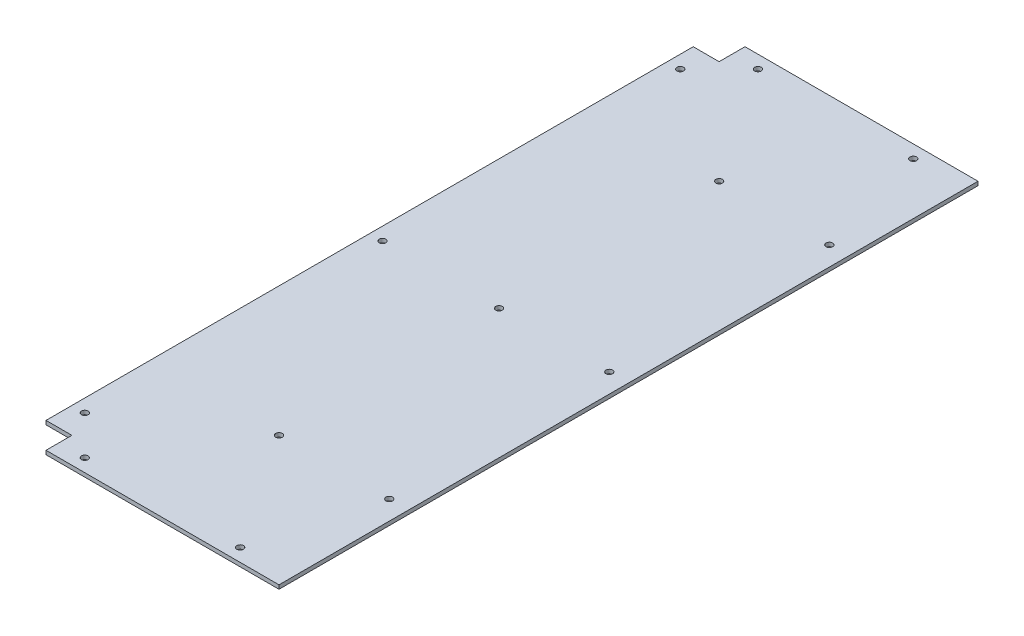
ISO-10303-21;
HEADER;
FILE_DESCRIPTION(('STEP AP214'),'2;1');
FILE_NAME('part.step','',(''),(''),'','','');
FILE_SCHEMA(('AUTOMOTIVE_DESIGN { 1 0 10303 214 1 1 1 1 }'));
ENDSEC;
DATA;
#1=APPLICATION_CONTEXT('core data for automotive mechanical design processes');
#2=APPLICATION_PROTOCOL_DEFINITION('international standard','automotive_design',2000,#1);
#3=PRODUCT_CONTEXT('',#1,'mechanical');
#4=PRODUCT('Part','Part','',(#3));
#5=PRODUCT_RELATED_PRODUCT_CATEGORY('part','',(#4));
#6=PRODUCT_DEFINITION_FORMATION('','',#4);
#7=PRODUCT_DEFINITION_CONTEXT('part definition',#1,'design');
#8=PRODUCT_DEFINITION('design','',#6,#7);
#9=PRODUCT_DEFINITION_SHAPE('','',#8);
#10=(LENGTH_UNIT() NAMED_UNIT(*) SI_UNIT(.MILLI.,.METRE.));
#11=(NAMED_UNIT(*) PLANE_ANGLE_UNIT() SI_UNIT($,.RADIAN.));
#12=(NAMED_UNIT(*) SI_UNIT($,.STERADIAN.) SOLID_ANGLE_UNIT());
#13=UNCERTAINTY_MEASURE_WITH_UNIT(LENGTH_MEASURE(1.E-05),#10,'distance_accuracy_value','');
#14=(GEOMETRIC_REPRESENTATION_CONTEXT(3) GLOBAL_UNCERTAINTY_ASSIGNED_CONTEXT((#13)) GLOBAL_UNIT_ASSIGNED_CONTEXT((#10,
#11,#12)) REPRESENTATION_CONTEXT('',''));
#15=CARTESIAN_POINT('',(0.,0.,0.));
#16=DIRECTION('',(0.,0.,1.));
#17=DIRECTION('',(1.,0.,0.));
#18=AXIS2_PLACEMENT_3D('',#15,#16,#17);
#19=CARTESIAN_POINT('',(0.,3.,0.));
#20=DIRECTION('',(0.,1.,0.));
#21=DIRECTION('',(0.,0.,1.));
#22=AXIS2_PLACEMENT_3D('',#19,#20,#21);
#23=PLANE('',#22);
#24=CARTESIAN_POINT('',(85.1649475621327,3.,-170.));
#25=DIRECTION('',(0.,1.,0.));
#26=DIRECTION('',(0.,0.,1.));
#27=AXIS2_PLACEMENT_3D('',#24,#25,#26);
#28=CIRCLE('',#27,2.54999999999999);
#29=CARTESIAN_POINT('',(85.1649475621327,3.,-167.45));
#30=VERTEX_POINT('',#29);
#31=EDGE_CURVE('E242',#30,#30,#28,.T.);
#32=ORIENTED_EDGE('',*,*,#31,.F.);
#33=EDGE_LOOP('',(#32));
#34=FACE_BOUND('',#33,.T.);
#35=CARTESIAN_POINT('',(-59.9999999999998,3.,260.));
#36=DIRECTION('',(0.,1.,0.));
#37=DIRECTION('',(0.,0.,1.));
#38=AXIS2_PLACEMENT_3D('',#35,#36,#37);
#39=CIRCLE('',#38,2.55000000000001);
#40=CARTESIAN_POINT('',(-59.9999999999998,3.,262.55));
#41=VERTEX_POINT('',#40);
#42=EDGE_CURVE('E230',#41,#41,#39,.T.);
#43=ORIENTED_EDGE('',*,*,#42,.F.);
#44=EDGE_LOOP('',(#43));
#45=FACE_BOUND('',#44,.T.);
#46=CARTESIAN_POINT('',(1.66533453693773E-13,3.,-170.));
#47=DIRECTION('',(0.,1.,0.));
#48=DIRECTION('',(0.,0.,1.));
#49=AXIS2_PLACEMENT_3D('',#46,#47,#48);
#50=CIRCLE('',#49,2.55);
#51=CARTESIAN_POINT('',(1.66533453693773E-13,3.,-167.45));
#52=VERTEX_POINT('',#51);
#53=EDGE_CURVE('E218',#52,#52,#50,.T.);
#54=ORIENTED_EDGE('',*,*,#53,.F.);
#55=EDGE_LOOP('',(#54));
#56=FACE_BOUND('',#55,.T.);
#57=CARTESIAN_POINT('',(60.0000000000002,3.,260.));
#58=DIRECTION('',(0.,1.,0.));
#59=DIRECTION('',(0.,0.,1.));
#60=AXIS2_PLACEMENT_3D('',#57,#58,#59);
#61=CIRCLE('',#60,2.55000000000001);
#62=CARTESIAN_POINT('',(60.0000000000002,3.,262.55));
#63=VERTEX_POINT('',#62);
#64=EDGE_CURVE('E206',#63,#63,#61,.T.);
#65=ORIENTED_EDGE('',*,*,#64,.F.);
#66=EDGE_LOOP('',(#65));
#67=FACE_BOUND('',#66,.T.);
#68=CARTESIAN_POINT('',(-89.9999999999998,3.,0.));
#69=DIRECTION('',(0.,1.,0.));
#70=DIRECTION('',(0.,0.,1.));
#71=AXIS2_PLACEMENT_3D('',#68,#69,#70);
#72=CIRCLE('',#71,2.54999999999999);
#73=CARTESIAN_POINT('',(-89.9999999999998,3.,2.54999999999999));
#74=VERTEX_POINT('',#73);
#75=EDGE_CURVE('E194',#74,#74,#72,.T.);
#76=ORIENTED_EDGE('',*,*,#75,.F.);
#77=EDGE_LOOP('',(#76));
#78=FACE_BOUND('',#77,.T.);
#79=CARTESIAN_POINT('',(60.0000000000001,3.,-260.));
#80=DIRECTION('',(0.,1.,0.));
#81=DIRECTION('',(0.,0.,1.));
#82=AXIS2_PLACEMENT_3D('',#79,#80,#81);
#83=CIRCLE('',#82,2.55000000000001);
#84=CARTESIAN_POINT('',(60.0000000000001,3.,-257.45));
#85=VERTEX_POINT('',#84);
#86=EDGE_CURVE('E182',#85,#85,#83,.T.);
#87=ORIENTED_EDGE('',*,*,#86,.F.);
#88=EDGE_LOOP('',(#87));
#89=FACE_BOUND('',#88,.T.);
#90=DIRECTION('',(0.,0.,-1.));
#91=VECTOR('',#90,1.);
#92=CARTESIAN_POINT('',(100.,3.,-270.));
#93=LINE('',#92,#91);
#94=CARTESIAN_POINT('',(100.,3.,270.));
#95=VERTEX_POINT('',#94);
#96=CARTESIAN_POINT('',(100.,3.,-270.));
#97=VERTEX_POINT('',#96);
#98=EDGE_CURVE('E145',#95,#97,#93,.T.);
#99=ORIENTED_EDGE('',*,*,#98,.T.);
#100=DIRECTION('',(-1.,0.,0.));
#101=VECTOR('',#100,1.);
#102=CARTESIAN_POINT('',(-79.9999999999999,3.,-270.));
#103=LINE('',#102,#101);
#104=CARTESIAN_POINT('',(-79.9999999999999,3.,-270.));
#105=VERTEX_POINT('',#104);
#106=EDGE_CURVE('E93',#97,#105,#103,.T.);
#107=ORIENTED_EDGE('',*,*,#106,.T.);
#108=DIRECTION('',(0.,0.,1.));
#109=VECTOR('',#108,1.);
#110=CARTESIAN_POINT('',(-79.9999999999999,3.,-270.));
#111=LINE('',#110,#109);
#112=CARTESIAN_POINT('',(-79.9999999999999,3.,-250.));
#113=VERTEX_POINT('',#112);
#114=EDGE_CURVE('E160',#105,#113,#111,.T.);
#115=ORIENTED_EDGE('',*,*,#114,.T.);
#116=DIRECTION('',(-1.,0.,0.));
#117=VECTOR('',#116,1.);
#118=CARTESIAN_POINT('',(-79.9999999999999,3.,-250.));
#119=LINE('',#118,#117);
#120=CARTESIAN_POINT('',(-99.9999999999999,3.,-250.));
#121=VERTEX_POINT('',#120);
#122=EDGE_CURVE('E173',#113,#121,#119,.T.);
#123=ORIENTED_EDGE('',*,*,#122,.T.);
#124=DIRECTION('',(0.,0.,1.));
#125=VECTOR('',#124,1.);
#126=CARTESIAN_POINT('',(-99.9999999999999,3.,-250.));
#127=LINE('',#126,#125);
#128=CARTESIAN_POINT('',(-99.9999999999998,3.,250.));
#129=VERTEX_POINT('',#128);
#130=EDGE_CURVE('E112',#121,#129,#127,.T.);
#131=ORIENTED_EDGE('',*,*,#130,.T.);
#132=DIRECTION('',(1.,0.,0.));
#133=VECTOR('',#132,1.);
#134=CARTESIAN_POINT('',(-99.9999999999998,3.,250.));
#135=LINE('',#134,#133);
#136=CARTESIAN_POINT('',(-79.9999999999998,3.,250.));
#137=VERTEX_POINT('',#136);
#138=EDGE_CURVE('E106',#129,#137,#135,.T.);
#139=ORIENTED_EDGE('',*,*,#138,.T.);
#140=DIRECTION('',(0.,0.,1.));
#141=VECTOR('',#140,1.);
#142=CARTESIAN_POINT('',(-79.9999999999998,3.,250.));
#143=LINE('',#142,#141);
#144=CARTESIAN_POINT('',(-79.9999999999998,3.,270.));
#145=VERTEX_POINT('',#144);
#146=EDGE_CURVE('E110',#137,#145,#143,.T.);
#147=ORIENTED_EDGE('',*,*,#146,.T.);
#148=DIRECTION('',(1.,0.,0.));
#149=VECTOR('',#148,1.);
#150=CARTESIAN_POINT('',(-79.9999999999998,3.,270.));
#151=LINE('',#150,#149);
#152=EDGE_CURVE('E50',#145,#95,#151,.T.);
#153=ORIENTED_EDGE('',*,*,#152,.T.);
#154=EDGE_LOOP('',(#99,#107,#115,#123,#131,#139,#147,#153));
#155=FACE_BOUND('',#154,.T.);
#156=CARTESIAN_POINT('',(-59.9999999999999,3.,-260.));
#157=DIRECTION('',(0.,1.,0.));
#158=DIRECTION('',(0.,0.,1.));
#159=AXIS2_PLACEMENT_3D('',#156,#157,#158);
#160=CIRCLE('',#159,2.55000000000001);
#161=CARTESIAN_POINT('',(-59.9999999999999,3.,-257.45));
#162=VERTEX_POINT('',#161);
#163=EDGE_CURVE('E134',#162,#162,#160,.T.);
#164=ORIENTED_EDGE('',*,*,#163,.F.);
#165=EDGE_LOOP('',(#164));
#166=FACE_BOUND('',#165,.T.);
#167=CARTESIAN_POINT('',(-89.9999999999999,3.,-230.));
#168=DIRECTION('',(0.,1.,0.));
#169=DIRECTION('',(0.,0.,1.));
#170=AXIS2_PLACEMENT_3D('',#167,#168,#169);
#171=CIRCLE('',#170,2.54999999999999);
#172=CARTESIAN_POINT('',(-89.9999999999999,3.,-227.45));
#173=VERTEX_POINT('',#172);
#174=EDGE_CURVE('E188',#173,#173,#171,.T.);
#175=ORIENTED_EDGE('',*,*,#174,.F.);
#176=EDGE_LOOP('',(#175));
#177=FACE_BOUND('',#176,.T.);
#178=CARTESIAN_POINT('',(-89.9999999999998,3.,230.));
#179=DIRECTION('',(0.,1.,0.));
#180=DIRECTION('',(0.,0.,1.));
#181=AXIS2_PLACEMENT_3D('',#178,#179,#180);
#182=CIRCLE('',#181,2.54999999999999);
#183=CARTESIAN_POINT('',(-89.9999999999998,3.,232.55));
#184=VERTEX_POINT('',#183);
#185=EDGE_CURVE('E200',#184,#184,#182,.T.);
#186=ORIENTED_EDGE('',*,*,#185,.F.);
#187=EDGE_LOOP('',(#186));
#188=FACE_BOUND('',#187,.T.);
#189=CARTESIAN_POINT('',(1.66533453693773E-13,3.,-1.11022302462516E-13));
#190=DIRECTION('',(0.,1.,0.));
#191=DIRECTION('',(0.,0.,1.));
#192=AXIS2_PLACEMENT_3D('',#189,#190,#191);
#193=CIRCLE('',#192,2.55);
#194=CARTESIAN_POINT('',(1.66533453693773E-13,3.,2.54999999999989));
#195=VERTEX_POINT('',#194);
#196=EDGE_CURVE('E212',#195,#195,#193,.T.);
#197=ORIENTED_EDGE('',*,*,#196,.F.);
#198=EDGE_LOOP('',(#197));
#199=FACE_BOUND('',#198,.T.);
#200=CARTESIAN_POINT('',(1.66533453693773E-13,3.,170.));
#201=DIRECTION('',(0.,1.,0.));
#202=DIRECTION('',(0.,0.,1.));
#203=AXIS2_PLACEMENT_3D('',#200,#201,#202);
#204=CIRCLE('',#203,2.55);
#205=CARTESIAN_POINT('',(1.66533453693773E-13,3.,172.55));
#206=VERTEX_POINT('',#205);
#207=EDGE_CURVE('E224',#206,#206,#204,.T.);
#208=ORIENTED_EDGE('',*,*,#207,.F.);
#209=EDGE_LOOP('',(#208));
#210=FACE_BOUND('',#209,.T.);
#211=CARTESIAN_POINT('',(85.1649475621327,3.,-1.11022302462516E-13));
#212=DIRECTION('',(0.,1.,0.));
#213=DIRECTION('',(0.,0.,1.));
#214=AXIS2_PLACEMENT_3D('',#211,#212,#213);
#215=CIRCLE('',#214,2.54999999999999);
#216=CARTESIAN_POINT('',(85.1649475621327,3.,2.54999999999988));
#217=VERTEX_POINT('',#216);
#218=EDGE_CURVE('E236',#217,#217,#215,.T.);
#219=ORIENTED_EDGE('',*,*,#218,.F.);
#220=EDGE_LOOP('',(#219));
#221=FACE_BOUND('',#220,.T.);
#222=CARTESIAN_POINT('',(85.1649475621327,3.,170.));
#223=DIRECTION('',(0.,1.,0.));
#224=DIRECTION('',(0.,0.,1.));
#225=AXIS2_PLACEMENT_3D('',#222,#223,#224);
#226=CIRCLE('',#225,2.54999999999999);
#227=CARTESIAN_POINT('',(85.1649475621327,3.,172.55));
#228=VERTEX_POINT('',#227);
#229=EDGE_CURVE('E248',#228,#228,#226,.T.);
#230=ORIENTED_EDGE('',*,*,#229,.F.);
#231=EDGE_LOOP('',(#230));
#232=FACE_BOUND('',#231,.T.);
#233=ADVANCED_FACE('F33',(#34,#45,#56,#67,#78,#89,#155,#166,#177,#188,#199,#210,#221,#232),#23,.T.);
#234=CARTESIAN_POINT('',(0.,0.,0.));
#235=DIRECTION('',(0.,1.,0.));
#236=DIRECTION('',(0.,0.,1.));
#237=AXIS2_PLACEMENT_3D('',#234,#235,#236);
#238=PLANE('',#237);
#239=DIRECTION('',(0.,0.,-1.));
#240=VECTOR('',#239,1.);
#241=CARTESIAN_POINT('',(100.,0.,-270.));
#242=LINE('',#241,#240);
#243=CARTESIAN_POINT('',(100.,0.,270.));
#244=VERTEX_POINT('',#243);
#245=CARTESIAN_POINT('',(100.,0.,-270.));
#246=VERTEX_POINT('',#245);
#247=EDGE_CURVE('E130',#244,#246,#242,.T.);
#248=ORIENTED_EDGE('',*,*,#247,.F.);
#249=DIRECTION('',(1.,0.,0.));
#250=VECTOR('',#249,1.);
#251=CARTESIAN_POINT('',(-79.9999999999998,0.,270.));
#252=LINE('',#251,#250);
#253=CARTESIAN_POINT('',(-79.9999999999998,0.,270.));
#254=VERTEX_POINT('',#253);
#255=EDGE_CURVE('E85',#254,#244,#252,.T.);
#256=ORIENTED_EDGE('',*,*,#255,.F.);
#257=DIRECTION('',(0.,0.,1.));
#258=VECTOR('',#257,1.);
#259=CARTESIAN_POINT('',(-79.9999999999998,0.,250.));
#260=LINE('',#259,#258);
#261=CARTESIAN_POINT('',(-79.9999999999998,0.,250.));
#262=VERTEX_POINT('',#261);
#263=EDGE_CURVE('E79',#262,#254,#260,.T.);
#264=ORIENTED_EDGE('',*,*,#263,.F.);
#265=DIRECTION('',(1.,0.,0.));
#266=VECTOR('',#265,1.);
#267=CARTESIAN_POINT('',(-99.9999999999998,0.,250.));
#268=LINE('',#267,#266);
#269=CARTESIAN_POINT('',(-99.9999999999998,0.,250.));
#270=VERTEX_POINT('',#269);
#271=EDGE_CURVE('E120',#270,#262,#268,.T.);
#272=ORIENTED_EDGE('',*,*,#271,.F.);
#273=DIRECTION('',(0.,0.,1.));
#274=VECTOR('',#273,1.);
#275=CARTESIAN_POINT('',(-99.9999999999999,0.,-250.));
#276=LINE('',#275,#274);
#277=CARTESIAN_POINT('',(-99.9999999999999,0.,-250.));
#278=VERTEX_POINT('',#277);
#279=EDGE_CURVE('E140',#278,#270,#276,.T.);
#280=ORIENTED_EDGE('',*,*,#279,.F.);
#281=DIRECTION('',(-1.,0.,0.));
#282=VECTOR('',#281,1.);
#283=CARTESIAN_POINT('',(-79.9999999999999,0.,-250.));
#284=LINE('',#283,#282);
#285=CARTESIAN_POINT('',(-79.9999999999999,0.,-250.));
#286=VERTEX_POINT('',#285);
#287=EDGE_CURVE('E138',#286,#278,#284,.T.);
#288=ORIENTED_EDGE('',*,*,#287,.F.);
#289=DIRECTION('',(0.,0.,1.));
#290=VECTOR('',#289,1.);
#291=CARTESIAN_POINT('',(-79.9999999999999,0.,-270.));
#292=LINE('',#291,#290);
#293=CARTESIAN_POINT('',(-79.9999999999999,0.,-270.));
#294=VERTEX_POINT('',#293);
#295=EDGE_CURVE('E136',#294,#286,#292,.T.);
#296=ORIENTED_EDGE('',*,*,#295,.F.);
#297=DIRECTION('',(-1.,0.,0.));
#298=VECTOR('',#297,1.);
#299=CARTESIAN_POINT('',(-79.9999999999999,0.,-270.));
#300=LINE('',#299,#298);
#301=EDGE_CURVE('E133',#246,#294,#300,.T.);
#302=ORIENTED_EDGE('',*,*,#301,.F.);
#303=EDGE_LOOP('',(#248,#256,#264,#272,#280,#288,#296,#302));
#304=FACE_BOUND('',#303,.T.);
#305=CARTESIAN_POINT('',(-59.9999999999999,0.,-260.));
#306=DIRECTION('',(0.,1.,0.));
#307=DIRECTION('',(0.,0.,1.));
#308=AXIS2_PLACEMENT_3D('',#305,#306,#307);
#309=CIRCLE('',#308,2.55000000000001);
#310=CARTESIAN_POINT('',(-59.9999999999999,0.,-257.45));
#311=VERTEX_POINT('',#310);
#312=EDGE_CURVE('E179',#311,#311,#309,.T.);
#313=ORIENTED_EDGE('',*,*,#312,.T.);
#314=EDGE_LOOP('',(#313));
#315=FACE_BOUND('',#314,.T.);
#316=CARTESIAN_POINT('',(60.0000000000001,0.,-260.));
#317=DIRECTION('',(0.,1.,0.));
#318=DIRECTION('',(0.,0.,1.));
#319=AXIS2_PLACEMENT_3D('',#316,#317,#318);
#320=CIRCLE('',#319,2.55000000000001);
#321=CARTESIAN_POINT('',(60.0000000000001,0.,-257.45));
#322=VERTEX_POINT('',#321);
#323=EDGE_CURVE('E185',#322,#322,#320,.T.);
#324=ORIENTED_EDGE('',*,*,#323,.T.);
#325=EDGE_LOOP('',(#324));
#326=FACE_BOUND('',#325,.T.);
#327=CARTESIAN_POINT('',(-89.9999999999999,0.,-230.));
#328=DIRECTION('',(0.,1.,0.));
#329=DIRECTION('',(0.,0.,1.));
#330=AXIS2_PLACEMENT_3D('',#327,#328,#329);
#331=CIRCLE('',#330,2.54999999999999);
#332=CARTESIAN_POINT('',(-89.9999999999999,0.,-227.45));
#333=VERTEX_POINT('',#332);
#334=EDGE_CURVE('E191',#333,#333,#331,.T.);
#335=ORIENTED_EDGE('',*,*,#334,.T.);
#336=EDGE_LOOP('',(#335));
#337=FACE_BOUND('',#336,.T.);
#338=CARTESIAN_POINT('',(-89.9999999999998,0.,0.));
#339=DIRECTION('',(0.,1.,0.));
#340=DIRECTION('',(0.,0.,1.));
#341=AXIS2_PLACEMENT_3D('',#338,#339,#340);
#342=CIRCLE('',#341,2.54999999999999);
#343=CARTESIAN_POINT('',(-89.9999999999998,0.,2.54999999999999));
#344=VERTEX_POINT('',#343);
#345=EDGE_CURVE('E197',#344,#344,#342,.T.);
#346=ORIENTED_EDGE('',*,*,#345,.T.);
#347=EDGE_LOOP('',(#346));
#348=FACE_BOUND('',#347,.T.);
#349=CARTESIAN_POINT('',(-89.9999999999998,0.,230.));
#350=DIRECTION('',(0.,1.,0.));
#351=DIRECTION('',(0.,0.,1.));
#352=AXIS2_PLACEMENT_3D('',#349,#350,#351);
#353=CIRCLE('',#352,2.54999999999999);
#354=CARTESIAN_POINT('',(-89.9999999999998,0.,232.55));
#355=VERTEX_POINT('',#354);
#356=EDGE_CURVE('E203',#355,#355,#353,.T.);
#357=ORIENTED_EDGE('',*,*,#356,.T.);
#358=EDGE_LOOP('',(#357));
#359=FACE_BOUND('',#358,.T.);
#360=CARTESIAN_POINT('',(60.0000000000002,0.,260.));
#361=DIRECTION('',(0.,1.,0.));
#362=DIRECTION('',(0.,0.,1.));
#363=AXIS2_PLACEMENT_3D('',#360,#361,#362);
#364=CIRCLE('',#363,2.55000000000001);
#365=CARTESIAN_POINT('',(60.0000000000002,0.,262.55));
#366=VERTEX_POINT('',#365);
#367=EDGE_CURVE('E209',#366,#366,#364,.T.);
#368=ORIENTED_EDGE('',*,*,#367,.T.);
#369=EDGE_LOOP('',(#368));
#370=FACE_BOUND('',#369,.T.);
#371=CARTESIAN_POINT('',(1.66533453693773E-13,0.,-1.11022302462516E-13));
#372=DIRECTION('',(0.,1.,0.));
#373=DIRECTION('',(0.,0.,1.));
#374=AXIS2_PLACEMENT_3D('',#371,#372,#373);
#375=CIRCLE('',#374,2.55);
#376=CARTESIAN_POINT('',(1.66533453693773E-13,0.,2.54999999999989));
#377=VERTEX_POINT('',#376);
#378=EDGE_CURVE('E215',#377,#377,#375,.T.);
#379=ORIENTED_EDGE('',*,*,#378,.T.);
#380=EDGE_LOOP('',(#379));
#381=FACE_BOUND('',#380,.T.);
#382=CARTESIAN_POINT('',(1.66533453693773E-13,0.,-170.));
#383=DIRECTION('',(0.,1.,0.));
#384=DIRECTION('',(0.,0.,1.));
#385=AXIS2_PLACEMENT_3D('',#382,#383,#384);
#386=CIRCLE('',#385,2.55);
#387=CARTESIAN_POINT('',(1.66533453693773E-13,0.,-167.45));
#388=VERTEX_POINT('',#387);
#389=EDGE_CURVE('E221',#388,#388,#386,.T.);
#390=ORIENTED_EDGE('',*,*,#389,.T.);
#391=EDGE_LOOP('',(#390));
#392=FACE_BOUND('',#391,.T.);
#393=CARTESIAN_POINT('',(1.66533453693773E-13,0.,170.));
#394=DIRECTION('',(0.,1.,0.));
#395=DIRECTION('',(0.,0.,1.));
#396=AXIS2_PLACEMENT_3D('',#393,#394,#395);
#397=CIRCLE('',#396,2.55);
#398=CARTESIAN_POINT('',(1.66533453693773E-13,0.,172.55));
#399=VERTEX_POINT('',#398);
#400=EDGE_CURVE('E227',#399,#399,#397,.T.);
#401=ORIENTED_EDGE('',*,*,#400,.T.);
#402=EDGE_LOOP('',(#401));
#403=FACE_BOUND('',#402,.T.);
#404=CARTESIAN_POINT('',(-59.9999999999998,0.,260.));
#405=DIRECTION('',(0.,1.,0.));
#406=DIRECTION('',(0.,0.,1.));
#407=AXIS2_PLACEMENT_3D('',#404,#405,#406);
#408=CIRCLE('',#407,2.55000000000001);
#409=CARTESIAN_POINT('',(-59.9999999999998,0.,262.55));
#410=VERTEX_POINT('',#409);
#411=EDGE_CURVE('E233',#410,#410,#408,.T.);
#412=ORIENTED_EDGE('',*,*,#411,.T.);
#413=EDGE_LOOP('',(#412));
#414=FACE_BOUND('',#413,.T.);
#415=CARTESIAN_POINT('',(85.1649475621327,0.,-1.11022302462516E-13));
#416=DIRECTION('',(0.,1.,0.));
#417=DIRECTION('',(0.,0.,1.));
#418=AXIS2_PLACEMENT_3D('',#415,#416,#417);
#419=CIRCLE('',#418,2.54999999999999);
#420=CARTESIAN_POINT('',(85.1649475621327,0.,2.54999999999988));
#421=VERTEX_POINT('',#420);
#422=EDGE_CURVE('E239',#421,#421,#419,.T.);
#423=ORIENTED_EDGE('',*,*,#422,.T.);
#424=EDGE_LOOP('',(#423));
#425=FACE_BOUND('',#424,.T.);
#426=CARTESIAN_POINT('',(85.1649475621327,0.,-170.));
#427=DIRECTION('',(0.,1.,0.));
#428=DIRECTION('',(0.,0.,1.));
#429=AXIS2_PLACEMENT_3D('',#426,#427,#428);
#430=CIRCLE('',#429,2.54999999999999);
#431=CARTESIAN_POINT('',(85.1649475621327,0.,-167.45));
#432=VERTEX_POINT('',#431);
#433=EDGE_CURVE('E245',#432,#432,#430,.T.);
#434=ORIENTED_EDGE('',*,*,#433,.T.);
#435=EDGE_LOOP('',(#434));
#436=FACE_BOUND('',#435,.T.);
#437=CARTESIAN_POINT('',(85.1649475621327,0.,170.));
#438=DIRECTION('',(0.,1.,0.));
#439=DIRECTION('',(0.,0.,1.));
#440=AXIS2_PLACEMENT_3D('',#437,#438,#439);
#441=CIRCLE('',#440,2.54999999999999);
#442=CARTESIAN_POINT('',(85.1649475621327,0.,172.55));
#443=VERTEX_POINT('',#442);
#444=EDGE_CURVE('E251',#443,#443,#441,.T.);
#445=ORIENTED_EDGE('',*,*,#444,.T.);
#446=EDGE_LOOP('',(#445));
#447=FACE_BOUND('',#446,.T.);
#448=ADVANCED_FACE('F164',(#304,#315,#326,#337,#348,#359,#370,#381,#392,#403,#414,#425,#436,
#447),#238,.F.);
#449=CARTESIAN_POINT('',(100.,3.,-270.));
#450=DIRECTION('',(-1.,0.,0.));
#451=DIRECTION('',(0.,0.,1.));
#452=AXIS2_PLACEMENT_3D('',#449,#450,#451);
#453=PLANE('',#452);
#454=ORIENTED_EDGE('',*,*,#247,.T.);
#455=DIRECTION('',(0.,-1.,0.));
#456=VECTOR('',#455,1.);
#457=CARTESIAN_POINT('',(100.,3.,-270.));
#458=LINE('',#457,#456);
#459=EDGE_CURVE('E11',#97,#246,#458,.T.);
#460=ORIENTED_EDGE('',*,*,#459,.F.);
#461=ORIENTED_EDGE('',*,*,#98,.F.);
#462=DIRECTION('',(0.,-1.,0.));
#463=VECTOR('',#462,1.);
#464=CARTESIAN_POINT('',(100.,3.,270.));
#465=LINE('',#464,#463);
#466=EDGE_CURVE('E126',#95,#244,#465,.T.);
#467=ORIENTED_EDGE('',*,*,#466,.T.);
#468=EDGE_LOOP('',(#454,#460,#461,#467));
#469=FACE_BOUND('',#468,.T.);
#470=ADVANCED_FACE('F35',(#469),#453,.F.);
#471=CARTESIAN_POINT('',(-79.9999999999999,3.,-270.));
#472=DIRECTION('',(0.,0.,1.));
#473=DIRECTION('',(1.,0.,0.));
#474=AXIS2_PLACEMENT_3D('',#471,#472,#473);
#475=PLANE('',#474);
#476=ORIENTED_EDGE('',*,*,#301,.T.);
#477=DIRECTION('',(0.,-1.,0.));
#478=VECTOR('',#477,1.);
#479=CARTESIAN_POINT('',(-79.9999999999999,3.,-270.));
#480=LINE('',#479,#478);
#481=EDGE_CURVE('E42',#105,#294,#480,.T.);
#482=ORIENTED_EDGE('',*,*,#481,.F.);
#483=ORIENTED_EDGE('',*,*,#106,.F.);
#484=ORIENTED_EDGE('',*,*,#459,.T.);
#485=EDGE_LOOP('',(#476,#482,#483,#484));
#486=FACE_BOUND('',#485,.T.);
#487=ADVANCED_FACE('F285',(#486),#475,.F.);
#488=CARTESIAN_POINT('',(-79.9999999999999,3.,-270.));
#489=DIRECTION('',(1.,0.,0.));
#490=DIRECTION('',(0.,0.,-1.));
#491=AXIS2_PLACEMENT_3D('',#488,#489,#490);
#492=PLANE('',#491);
#493=ORIENTED_EDGE('',*,*,#295,.T.);
#494=DIRECTION('',(0.,-1.,0.));
#495=VECTOR('',#494,1.);
#496=CARTESIAN_POINT('',(-79.9999999999999,3.,-250.));
#497=LINE('',#496,#495);
#498=EDGE_CURVE('E152',#113,#286,#497,.T.);
#499=ORIENTED_EDGE('',*,*,#498,.F.);
#500=ORIENTED_EDGE('',*,*,#114,.F.);
#501=ORIENTED_EDGE('',*,*,#481,.T.);
#502=EDGE_LOOP('',(#493,#499,#500,#501));
#503=FACE_BOUND('',#502,.T.);
#504=ADVANCED_FACE('F158',(#503),#492,.F.);
#505=CARTESIAN_POINT('',(-79.9999999999999,3.,-250.));
#506=DIRECTION('',(0.,0.,1.));
#507=DIRECTION('',(1.,0.,0.));
#508=AXIS2_PLACEMENT_3D('',#505,#506,#507);
#509=PLANE('',#508);
#510=ORIENTED_EDGE('',*,*,#287,.T.);
#511=DIRECTION('',(0.,-1.,0.));
#512=VECTOR('',#511,1.);
#513=CARTESIAN_POINT('',(-99.9999999999999,3.,-250.));
#514=LINE('',#513,#512);
#515=EDGE_CURVE('E149',#121,#278,#514,.T.);
#516=ORIENTED_EDGE('',*,*,#515,.F.);
#517=ORIENTED_EDGE('',*,*,#122,.F.);
#518=ORIENTED_EDGE('',*,*,#498,.T.);
#519=EDGE_LOOP('',(#510,#516,#517,#518));
#520=FACE_BOUND('',#519,.T.);
#521=ADVANCED_FACE('F169',(#520),#509,.F.);
#522=CARTESIAN_POINT('',(-99.9999999999999,3.,-250.));
#523=DIRECTION('',(1.,0.,0.));
#524=DIRECTION('',(0.,0.,-1.));
#525=AXIS2_PLACEMENT_3D('',#522,#523,#524);
#526=PLANE('',#525);
#527=ORIENTED_EDGE('',*,*,#279,.T.);
#528=DIRECTION('',(0.,-1.,0.));
#529=VECTOR('',#528,1.);
#530=CARTESIAN_POINT('',(-99.9999999999998,3.,250.));
#531=LINE('',#530,#529);
#532=EDGE_CURVE('E121',#129,#270,#531,.T.);
#533=ORIENTED_EDGE('',*,*,#532,.F.);
#534=ORIENTED_EDGE('',*,*,#130,.F.);
#535=ORIENTED_EDGE('',*,*,#515,.T.);
#536=EDGE_LOOP('',(#527,#533,#534,#535));
#537=FACE_BOUND('',#536,.T.);
#538=ADVANCED_FACE('F172',(#537),#526,.F.);
#539=CARTESIAN_POINT('',(-99.9999999999998,3.,250.));
#540=DIRECTION('',(0.,0.,-1.));
#541=DIRECTION('',(-1.,0.,0.));
#542=AXIS2_PLACEMENT_3D('',#539,#540,#541);
#543=PLANE('',#542);
#544=ORIENTED_EDGE('',*,*,#271,.T.);
#545=DIRECTION('',(0.,-1.,0.));
#546=VECTOR('',#545,1.);
#547=CARTESIAN_POINT('',(-79.9999999999998,3.,250.));
#548=LINE('',#547,#546);
#549=EDGE_CURVE('E117',#137,#262,#548,.T.);
#550=ORIENTED_EDGE('',*,*,#549,.F.);
#551=ORIENTED_EDGE('',*,*,#138,.F.);
#552=ORIENTED_EDGE('',*,*,#532,.T.);
#553=EDGE_LOOP('',(#544,#550,#551,#552));
#554=FACE_BOUND('',#553,.T.);
#555=ADVANCED_FACE('F118',(#554),#543,.F.);
#556=CARTESIAN_POINT('',(-79.9999999999998,3.,250.));
#557=DIRECTION('',(1.,0.,0.));
#558=DIRECTION('',(0.,0.,-1.));
#559=AXIS2_PLACEMENT_3D('',#556,#557,#558);
#560=PLANE('',#559);
#561=ORIENTED_EDGE('',*,*,#263,.T.);
#562=DIRECTION('',(0.,-1.,0.));
#563=VECTOR('',#562,1.);
#564=CARTESIAN_POINT('',(-79.9999999999998,3.,270.));
#565=LINE('',#564,#563);
#566=EDGE_CURVE('E122',#145,#254,#565,.T.);
#567=ORIENTED_EDGE('',*,*,#566,.F.);
#568=ORIENTED_EDGE('',*,*,#146,.F.);
#569=ORIENTED_EDGE('',*,*,#549,.T.);
#570=EDGE_LOOP('',(#561,#567,#568,#569));
#571=FACE_BOUND('',#570,.T.);
#572=ADVANCED_FACE('F124',(#571),#560,.F.);
#573=CARTESIAN_POINT('',(-79.9999999999998,3.,270.));
#574=DIRECTION('',(0.,0.,-1.));
#575=DIRECTION('',(-1.,0.,0.));
#576=AXIS2_PLACEMENT_3D('',#573,#574,#575);
#577=PLANE('',#576);
#578=ORIENTED_EDGE('',*,*,#255,.T.);
#579=ORIENTED_EDGE('',*,*,#466,.F.);
#580=ORIENTED_EDGE('',*,*,#152,.F.);
#581=ORIENTED_EDGE('',*,*,#566,.T.);
#582=EDGE_LOOP('',(#578,#579,#580,#581));
#583=FACE_BOUND('',#582,.T.);
#584=ADVANCED_FACE('F273',(#583),#577,.F.);
#585=CARTESIAN_POINT('',(-59.9999999999999,3.,-260.));
#586=DIRECTION('',(0.,-1.,0.));
#587=DIRECTION('',(0.,0.,-1.));
#588=AXIS2_PLACEMENT_3D('',#585,#586,#587);
#589=CYLINDRICAL_SURFACE('',#588,2.55000000000001);
#590=ORIENTED_EDGE('',*,*,#163,.T.);
#591=EDGE_LOOP('',(#590));
#592=FACE_BOUND('',#591,.T.);
#593=ORIENTED_EDGE('',*,*,#312,.F.);
#594=EDGE_LOOP('',(#593));
#595=FACE_BOUND('',#594,.T.);
#596=ADVANCED_FACE('F270',(#592,#595),#589,.F.);
#597=CARTESIAN_POINT('',(60.0000000000001,3.,-260.));
#598=DIRECTION('',(0.,-1.,0.));
#599=DIRECTION('',(0.,0.,-1.));
#600=AXIS2_PLACEMENT_3D('',#597,#598,#599);
#601=CYLINDRICAL_SURFACE('',#600,2.55000000000001);
#602=ORIENTED_EDGE('',*,*,#86,.T.);
#603=EDGE_LOOP('',(#602));
#604=FACE_BOUND('',#603,.T.);
#605=ORIENTED_EDGE('',*,*,#323,.F.);
#606=EDGE_LOOP('',(#605));
#607=FACE_BOUND('',#606,.T.);
#608=ADVANCED_FACE('F349',(#604,#607),#601,.F.);
#609=CARTESIAN_POINT('',(-89.9999999999999,3.,-230.));
#610=DIRECTION('',(0.,-1.,0.));
#611=DIRECTION('',(0.,0.,-1.));
#612=AXIS2_PLACEMENT_3D('',#609,#610,#611);
#613=CYLINDRICAL_SURFACE('',#612,2.54999999999999);
#614=ORIENTED_EDGE('',*,*,#174,.T.);
#615=EDGE_LOOP('',(#614));
#616=FACE_BOUND('',#615,.T.);
#617=ORIENTED_EDGE('',*,*,#334,.F.);
#618=EDGE_LOOP('',(#617));
#619=FACE_BOUND('',#618,.T.);
#620=ADVANCED_FACE('F357',(#616,#619),#613,.F.);
#621=CARTESIAN_POINT('',(-89.9999999999998,3.,0.));
#622=DIRECTION('',(0.,-1.,0.));
#623=DIRECTION('',(0.,0.,-1.));
#624=AXIS2_PLACEMENT_3D('',#621,#622,#623);
#625=CYLINDRICAL_SURFACE('',#624,2.54999999999999);
#626=ORIENTED_EDGE('',*,*,#75,.T.);
#627=EDGE_LOOP('',(#626));
#628=FACE_BOUND('',#627,.T.);
#629=ORIENTED_EDGE('',*,*,#345,.F.);
#630=EDGE_LOOP('',(#629));
#631=FACE_BOUND('',#630,.T.);
#632=ADVANCED_FACE('F365',(#628,#631),#625,.F.);
#633=CARTESIAN_POINT('',(-89.9999999999998,3.,230.));
#634=DIRECTION('',(0.,-1.,0.));
#635=DIRECTION('',(0.,0.,-1.));
#636=AXIS2_PLACEMENT_3D('',#633,#634,#635);
#637=CYLINDRICAL_SURFACE('',#636,2.54999999999999);
#638=ORIENTED_EDGE('',*,*,#185,.T.);
#639=EDGE_LOOP('',(#638));
#640=FACE_BOUND('',#639,.T.);
#641=ORIENTED_EDGE('',*,*,#356,.F.);
#642=EDGE_LOOP('',(#641));
#643=FACE_BOUND('',#642,.T.);
#644=ADVANCED_FACE('F374',(#640,#643),#637,.F.);
#645=CARTESIAN_POINT('',(60.0000000000002,3.,260.));
#646=DIRECTION('',(0.,-1.,0.));
#647=DIRECTION('',(0.,0.,-1.));
#648=AXIS2_PLACEMENT_3D('',#645,#646,#647);
#649=CYLINDRICAL_SURFACE('',#648,2.55000000000001);
#650=ORIENTED_EDGE('',*,*,#64,.T.);
#651=EDGE_LOOP('',(#650));
#652=FACE_BOUND('',#651,.T.);
#653=ORIENTED_EDGE('',*,*,#367,.F.);
#654=EDGE_LOOP('',(#653));
#655=FACE_BOUND('',#654,.T.);
#656=ADVANCED_FACE('F383',(#652,#655),#649,.F.);
#657=CARTESIAN_POINT('',(1.66533453693773E-13,3.,-1.11022302462516E-13));
#658=DIRECTION('',(0.,-1.,0.));
#659=DIRECTION('',(0.,0.,-1.));
#660=AXIS2_PLACEMENT_3D('',#657,#658,#659);
#661=CYLINDRICAL_SURFACE('',#660,2.55);
#662=ORIENTED_EDGE('',*,*,#196,.T.);
#663=EDGE_LOOP('',(#662));
#664=FACE_BOUND('',#663,.T.);
#665=ORIENTED_EDGE('',*,*,#378,.F.);
#666=EDGE_LOOP('',(#665));
#667=FACE_BOUND('',#666,.T.);
#668=ADVANCED_FACE('F392',(#664,#667),#661,.F.);
#669=CARTESIAN_POINT('',(1.66533453693773E-13,3.,-170.));
#670=DIRECTION('',(0.,-1.,0.));
#671=DIRECTION('',(0.,0.,-1.));
#672=AXIS2_PLACEMENT_3D('',#669,#670,#671);
#673=CYLINDRICAL_SURFACE('',#672,2.55);
#674=ORIENTED_EDGE('',*,*,#53,.T.);
#675=EDGE_LOOP('',(#674));
#676=FACE_BOUND('',#675,.T.);
#677=ORIENTED_EDGE('',*,*,#389,.F.);
#678=EDGE_LOOP('',(#677));
#679=FACE_BOUND('',#678,.T.);
#680=ADVANCED_FACE('F401',(#676,#679),#673,.F.);
#681=CARTESIAN_POINT('',(1.66533453693773E-13,3.,170.));
#682=DIRECTION('',(0.,-1.,0.));
#683=DIRECTION('',(0.,0.,-1.));
#684=AXIS2_PLACEMENT_3D('',#681,#682,#683);
#685=CYLINDRICAL_SURFACE('',#684,2.55);
#686=ORIENTED_EDGE('',*,*,#207,.T.);
#687=EDGE_LOOP('',(#686));
#688=FACE_BOUND('',#687,.T.);
#689=ORIENTED_EDGE('',*,*,#400,.F.);
#690=EDGE_LOOP('',(#689));
#691=FACE_BOUND('',#690,.T.);
#692=ADVANCED_FACE('F410',(#688,#691),#685,.F.);
#693=CARTESIAN_POINT('',(-59.9999999999998,3.,260.));
#694=DIRECTION('',(0.,-1.,0.));
#695=DIRECTION('',(0.,0.,-1.));
#696=AXIS2_PLACEMENT_3D('',#693,#694,#695);
#697=CYLINDRICAL_SURFACE('',#696,2.55000000000001);
#698=ORIENTED_EDGE('',*,*,#42,.T.);
#699=EDGE_LOOP('',(#698));
#700=FACE_BOUND('',#699,.T.);
#701=ORIENTED_EDGE('',*,*,#411,.F.);
#702=EDGE_LOOP('',(#701));
#703=FACE_BOUND('',#702,.T.);
#704=ADVANCED_FACE('F419',(#700,#703),#697,.F.);
#705=CARTESIAN_POINT('',(85.1649475621327,3.,-1.11022302462516E-13));
#706=DIRECTION('',(0.,-1.,0.));
#707=DIRECTION('',(0.,0.,-1.));
#708=AXIS2_PLACEMENT_3D('',#705,#706,#707);
#709=CYLINDRICAL_SURFACE('',#708,2.54999999999999);
#710=ORIENTED_EDGE('',*,*,#218,.T.);
#711=EDGE_LOOP('',(#710));
#712=FACE_BOUND('',#711,.T.);
#713=ORIENTED_EDGE('',*,*,#422,.F.);
#714=EDGE_LOOP('',(#713));
#715=FACE_BOUND('',#714,.T.);
#716=ADVANCED_FACE('F428',(#712,#715),#709,.F.);
#717=CARTESIAN_POINT('',(85.1649475621327,3.,-170.));
#718=DIRECTION('',(0.,-1.,0.));
#719=DIRECTION('',(0.,0.,-1.));
#720=AXIS2_PLACEMENT_3D('',#717,#718,#719);
#721=CYLINDRICAL_SURFACE('',#720,2.54999999999999);
#722=ORIENTED_EDGE('',*,*,#31,.T.);
#723=EDGE_LOOP('',(#722));
#724=FACE_BOUND('',#723,.T.);
#725=ORIENTED_EDGE('',*,*,#433,.F.);
#726=EDGE_LOOP('',(#725));
#727=FACE_BOUND('',#726,.T.);
#728=ADVANCED_FACE('F437',(#724,#727),#721,.F.);
#729=CARTESIAN_POINT('',(85.1649475621327,3.,170.));
#730=DIRECTION('',(0.,-1.,0.));
#731=DIRECTION('',(0.,0.,-1.));
#732=AXIS2_PLACEMENT_3D('',#729,#730,#731);
#733=CYLINDRICAL_SURFACE('',#732,2.54999999999999);
#734=ORIENTED_EDGE('',*,*,#229,.T.);
#735=EDGE_LOOP('',(#734));
#736=FACE_BOUND('',#735,.T.);
#737=ORIENTED_EDGE('',*,*,#444,.F.);
#738=EDGE_LOOP('',(#737));
#739=FACE_BOUND('',#738,.T.);
#740=ADVANCED_FACE('F257',(#736,#739),#733,.F.);
#741=CLOSED_SHELL('',(#233,#448,#470,#487,#504,#521,#538,#555,#572,#584,#596,#608,#620,#632,
#644,#656,#668,#680,#692,#704,#716,#728,#740));
#742=MANIFOLD_SOLID_BREP('B2',#741);
#743=ADVANCED_BREP_SHAPE_REPRESENTATION('',(#18,#742),#14);
#744=SHAPE_DEFINITION_REPRESENTATION(#9,#743);
ENDSEC;
END-ISO-10303-21;
